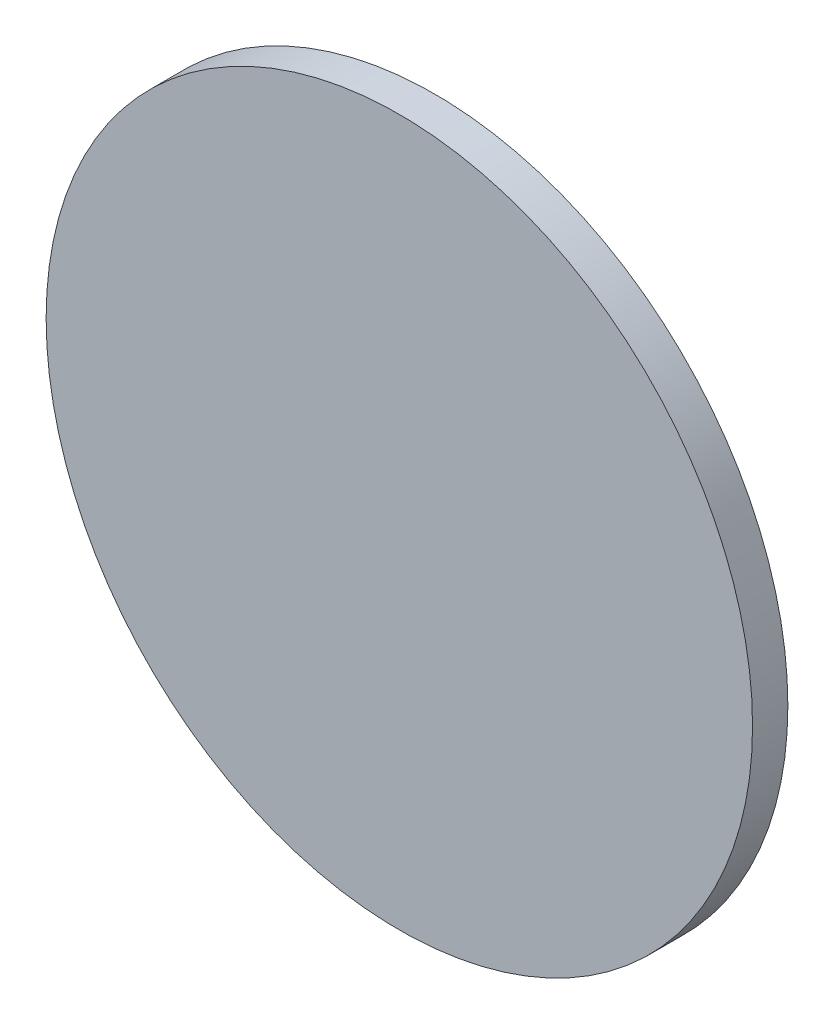
ISO-10303-21;
HEADER;
FILE_DESCRIPTION(('STEP AP214'),'2;1');
FILE_NAME('part.step','',(''),(''),'','','');
FILE_SCHEMA(('AUTOMOTIVE_DESIGN { 1 0 10303 214 1 1 1 1 }'));
ENDSEC;
DATA;
#1=APPLICATION_CONTEXT('core data for automotive mechanical design processes');
#2=APPLICATION_PROTOCOL_DEFINITION('international standard','automotive_design',2000,#1);
#3=PRODUCT_CONTEXT('',#1,'mechanical');
#4=PRODUCT('Part','Part','',(#3));
#5=PRODUCT_RELATED_PRODUCT_CATEGORY('part','',(#4));
#6=PRODUCT_DEFINITION_FORMATION('','',#4);
#7=PRODUCT_DEFINITION_CONTEXT('part definition',#1,'design');
#8=PRODUCT_DEFINITION('design','',#6,#7);
#9=PRODUCT_DEFINITION_SHAPE('','',#8);
#10=(LENGTH_UNIT() NAMED_UNIT(*) SI_UNIT(.MILLI.,.METRE.));
#11=(NAMED_UNIT(*) PLANE_ANGLE_UNIT() SI_UNIT($,.RADIAN.));
#12=(NAMED_UNIT(*) SI_UNIT($,.STERADIAN.) SOLID_ANGLE_UNIT());
#13=UNCERTAINTY_MEASURE_WITH_UNIT(LENGTH_MEASURE(1.E-05),#10,'distance_accuracy_value','');
#14=(GEOMETRIC_REPRESENTATION_CONTEXT(3) GLOBAL_UNCERTAINTY_ASSIGNED_CONTEXT((#13)) GLOBAL_UNIT_ASSIGNED_CONTEXT((#10,
#11,#12)) REPRESENTATION_CONTEXT('',''));
#15=CARTESIAN_POINT('',(0.,0.,0.));
#16=DIRECTION('',(0.,0.,1.));
#17=DIRECTION('',(1.,0.,0.));
#18=AXIS2_PLACEMENT_3D('',#15,#16,#17);
#19=CARTESIAN_POINT('',(0.0999998,0.,0.00999998));
#20=DIRECTION('',(0.,0.,-1.));
#21=DIRECTION('',(0.,-1.,0.));
#22=AXIS2_PLACEMENT_3D('',#19,#20,#21);
#23=PLANE('',#22);
#24=CARTESIAN_POINT('',(0.,0.,0.00999998));
#25=DIRECTION('',(0.,0.,1.));
#26=DIRECTION('',(1.,0.,0.));
#27=AXIS2_PLACEMENT_3D('',#24,#25,#26);
#28=CIRCLE('',#27,0.0999998);
#29=CARTESIAN_POINT('',(0.0999998,0.,0.00999998));
#30=VERTEX_POINT('',#29);
#31=EDGE_CURVE('E11',#30,#30,#28,.T.);
#32=ORIENTED_EDGE('',*,*,#31,.T.);
#33=EDGE_LOOP('',(#32));
#34=FACE_BOUND('',#33,.T.);
#35=ADVANCED_FACE('F17',(#34),#23,.F.);
#36=CARTESIAN_POINT('',(0.0999998,0.,0.));
#37=DIRECTION('',(0.,0.,-1.));
#38=DIRECTION('',(0.,-1.,0.));
#39=AXIS2_PLACEMENT_3D('',#36,#37,#38);
#40=PLANE('',#39);
#41=CARTESIAN_POINT('',(0.,0.,0.));
#42=DIRECTION('',(0.,0.,1.));
#43=DIRECTION('',(1.,0.,0.));
#44=AXIS2_PLACEMENT_3D('',#41,#42,#43);
#45=CIRCLE('',#44,0.0999998);
#46=CARTESIAN_POINT('',(0.0999998,0.,0.));
#47=VERTEX_POINT('',#46);
#48=EDGE_CURVE('E42',#47,#47,#45,.T.);
#49=ORIENTED_EDGE('',*,*,#48,.F.);
#50=EDGE_LOOP('',(#49));
#51=FACE_BOUND('',#50,.T.);
#52=ADVANCED_FACE('F64',(#51),#40,.T.);
#53=CARTESIAN_POINT('',(0.,0.,0.));
#54=DIRECTION('',(0.,0.,-1.));
#55=DIRECTION('',(1.,0.,0.));
#56=AXIS2_PLACEMENT_3D('',#53,#54,#55);
#57=CYLINDRICAL_SURFACE('',#56,0.0999998);
#58=ORIENTED_EDGE('',*,*,#48,.T.);
#59=DIRECTION('',(0.,0.,1.));
#60=VECTOR('',#59,1.);
#61=CARTESIAN_POINT('',(0.0999998,0.,0.));
#62=LINE('',#61,#60);
#63=EDGE_CURVE('E20',#47,#30,#62,.T.);
#64=ORIENTED_EDGE('',*,*,#63,.T.);
#65=ORIENTED_EDGE('',*,*,#31,.F.);
#66=ORIENTED_EDGE('',*,*,#63,.F.);
#67=EDGE_LOOP('',(#58,#64,#65,#66));
#68=FACE_BOUND('',#67,.T.);
#69=ADVANCED_FACE('F40',(#68),#57,.T.);
#70=CLOSED_SHELL('',(#35,#52,#69));
#71=MANIFOLD_SOLID_BREP('B1',#70);
#72=ADVANCED_BREP_SHAPE_REPRESENTATION('',(#18,#71),#14);
#73=SHAPE_DEFINITION_REPRESENTATION(#9,#72);
ENDSEC;
END-ISO-10303-21;
